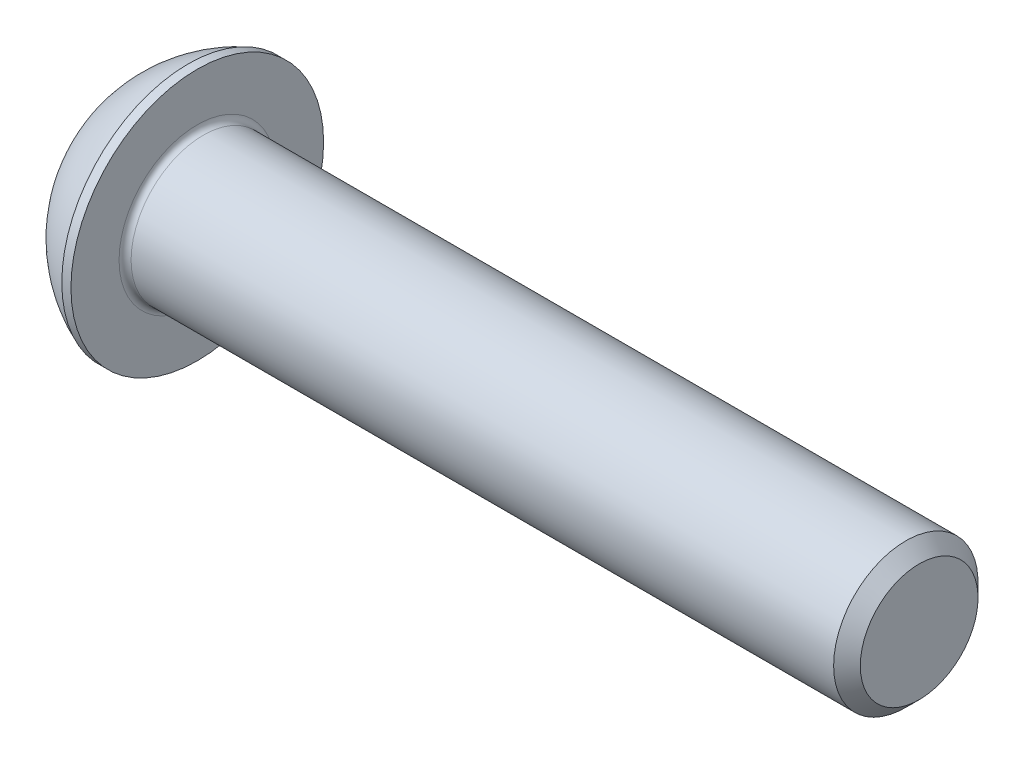
ISO-10303-21;
HEADER;
FILE_DESCRIPTION(('STEP AP214'),'2;1');
FILE_NAME('part.step','',(''),(''),'','','');
FILE_SCHEMA(('AUTOMOTIVE_DESIGN { 1 0 10303 214 1 1 1 1 }'));
ENDSEC;
DATA;
#1=APPLICATION_CONTEXT('core data for automotive mechanical design processes');
#2=APPLICATION_PROTOCOL_DEFINITION('international standard','automotive_design',2000,#1);
#3=PRODUCT_CONTEXT('',#1,'mechanical');
#4=PRODUCT('Part','Part','',(#3));
#5=PRODUCT_RELATED_PRODUCT_CATEGORY('part','',(#4));
#6=PRODUCT_DEFINITION_FORMATION('','',#4);
#7=PRODUCT_DEFINITION_CONTEXT('part definition',#1,'design');
#8=PRODUCT_DEFINITION('design','',#6,#7);
#9=PRODUCT_DEFINITION_SHAPE('','',#8);
#10=(LENGTH_UNIT() NAMED_UNIT(*) SI_UNIT(.MILLI.,.METRE.));
#11=(NAMED_UNIT(*) PLANE_ANGLE_UNIT() SI_UNIT($,.RADIAN.));
#12=(NAMED_UNIT(*) SI_UNIT($,.STERADIAN.) SOLID_ANGLE_UNIT());
#13=UNCERTAINTY_MEASURE_WITH_UNIT(LENGTH_MEASURE(1.E-05),#10,'distance_accuracy_value','');
#14=(GEOMETRIC_REPRESENTATION_CONTEXT(3) GLOBAL_UNCERTAINTY_ASSIGNED_CONTEXT((#13)) GLOBAL_UNIT_ASSIGNED_CONTEXT((#10,
#11,#12)) REPRESENTATION_CONTEXT('',''));
#15=CARTESIAN_POINT('',(0.,0.,0.));
#16=DIRECTION('',(0.,0.,1.));
#17=DIRECTION('',(1.,0.,0.));
#18=AXIS2_PLACEMENT_3D('',#15,#16,#17);
#19=CARTESIAN_POINT('',(0.,0.,0.));
#20=DIRECTION('',(-1.,0.,0.));
#21=DIRECTION('',(0.,0.,1.));
#22=AXIS2_PLACEMENT_3D('',#19,#20,#21);
#23=PLANE('',#22);
#24=CARTESIAN_POINT('',(0.,0.,0.));
#25=DIRECTION('',(-1.,0.,0.));
#26=DIRECTION('',(0.,0.,1.));
#27=AXIS2_PLACEMENT_3D('',#24,#25,#26);
#28=CIRCLE('',#27,2.625);
#29=CARTESIAN_POINT('',(0.,0.,2.625));
#30=VERTEX_POINT('',#29);
#31=EDGE_CURVE('E157',#30,#30,#28,.T.);
#32=ORIENTED_EDGE('',*,*,#31,.T.);
#33=EDGE_LOOP('',(#32));
#34=FACE_BOUND('',#33,.T.);
#35=DIRECTION('',(0.,-1.,0.));
#36=VECTOR('',#35,1.);
#37=CARTESIAN_POINT('',(0.,-1.15470053837925,2.));
#38=LINE('',#37,#36);
#39=CARTESIAN_POINT('',(0.,1.15470053837925,2.));
#40=VERTEX_POINT('',#39);
#41=CARTESIAN_POINT('',(0.,-1.15470053837925,2.));
#42=VERTEX_POINT('',#41);
#43=EDGE_CURVE('E52',#40,#42,#38,.T.);
#44=ORIENTED_EDGE('',*,*,#43,.T.);
#45=DIRECTION('',(0.,-0.5,-0.866025403784438));
#46=VECTOR('',#45,1.);
#47=CARTESIAN_POINT('',(0.,-2.3094010767585,0.));
#48=LINE('',#47,#46);
#49=CARTESIAN_POINT('',(0.,-2.3094010767585,0.));
#50=VERTEX_POINT('',#49);
#51=EDGE_CURVE('E277',#42,#50,#48,.T.);
#52=ORIENTED_EDGE('',*,*,#51,.T.);
#53=DIRECTION('',(0.,0.5,-0.866025403784439));
#54=VECTOR('',#53,1.);
#55=CARTESIAN_POINT('',(0.,-1.15470053837925,-2.));
#56=LINE('',#55,#54);
#57=CARTESIAN_POINT('',(0.,-1.15470053837925,-2.));
#58=VERTEX_POINT('',#57);
#59=EDGE_CURVE('E132',#50,#58,#56,.T.);
#60=ORIENTED_EDGE('',*,*,#59,.T.);
#61=DIRECTION('',(0.,1.,0.));
#62=VECTOR('',#61,1.);
#63=CARTESIAN_POINT('',(0.,1.15470053837925,-2.));
#64=LINE('',#63,#62);
#65=CARTESIAN_POINT('',(0.,1.15470053837925,-2.));
#66=VERTEX_POINT('',#65);
#67=EDGE_CURVE('E280',#58,#66,#64,.T.);
#68=ORIENTED_EDGE('',*,*,#67,.T.);
#69=DIRECTION('',(0.,0.5,0.866025403784439));
#70=VECTOR('',#69,1.);
#71=CARTESIAN_POINT('',(0.,2.3094010767585,0.));
#72=LINE('',#71,#70);
#73=CARTESIAN_POINT('',(0.,2.3094010767585,0.));
#74=VERTEX_POINT('',#73);
#75=EDGE_CURVE('E282',#66,#74,#72,.T.);
#76=ORIENTED_EDGE('',*,*,#75,.T.);
#77=DIRECTION('',(0.,-0.5,0.866025403784439));
#78=VECTOR('',#77,1.);
#79=CARTESIAN_POINT('',(0.,1.15470053837925,2.));
#80=LINE('',#79,#78);
#81=EDGE_CURVE('E284',#74,#40,#80,.T.);
#82=ORIENTED_EDGE('',*,*,#81,.T.);
#83=EDGE_LOOP('',(#44,#52,#60,#68,#76,#82));
#84=FACE_BOUND('',#83,.T.);
#85=ADVANCED_FACE('F37',(#34,#84),#23,.T.);
#86=CARTESIAN_POINT('',(4.99970462328768,0.,0.));
#87=DIRECTION('',(-1.,0.,0.));
#88=DIRECTION('',(0.,1.,0.));
#89=AXIS2_PLACEMENT_3D('',#86,#87,#88);
#90=SPHERICAL_SURFACE('',#89,5.64691697478581);
#91=CARTESIAN_POINT('',(2.92,0.,0.));
#92=DIRECTION('',(-1.,0.,0.));
#93=DIRECTION('',(0.,0.,1.));
#94=AXIS2_PLACEMENT_3D('',#91,#92,#93);
#95=CIRCLE('',#94,5.25);
#96=CARTESIAN_POINT('',(2.92,0.,5.25));
#97=VERTEX_POINT('',#96);
#98=EDGE_CURVE('E154',#97,#97,#95,.T.);
#99=ORIENTED_EDGE('',*,*,#98,.T.);
#100=EDGE_LOOP('',(#99));
#101=FACE_BOUND('',#100,.T.);
#102=ORIENTED_EDGE('',*,*,#31,.F.);
#103=EDGE_LOOP('',(#102));
#104=FACE_BOUND('',#103,.T.);
#105=ADVANCED_FACE('F178',(#101,#104),#90,.T.);
#106=CARTESIAN_POINT('',(0.,0.,0.));
#107=DIRECTION('',(-1.,0.,0.));
#108=DIRECTION('',(0.,0.,1.));
#109=AXIS2_PLACEMENT_3D('',#106,#107,#108);
#110=CYLINDRICAL_SURFACE('',#109,5.25);
#111=ORIENTED_EDGE('',*,*,#98,.F.);
#112=EDGE_LOOP('',(#111));
#113=FACE_BOUND('',#112,.T.);
#114=CARTESIAN_POINT('',(3.3,0.,0.));
#115=DIRECTION('',(-1.,0.,0.));
#116=DIRECTION('',(0.,0.,1.));
#117=AXIS2_PLACEMENT_3D('',#114,#115,#116);
#118=CIRCLE('',#117,5.25);
#119=CARTESIAN_POINT('',(3.3,0.,5.25));
#120=VERTEX_POINT('',#119);
#121=EDGE_CURVE('E151',#120,#120,#118,.T.);
#122=ORIENTED_EDGE('',*,*,#121,.T.);
#123=EDGE_LOOP('',(#122));
#124=FACE_BOUND('',#123,.T.);
#125=ADVANCED_FACE('F183',(#113,#124),#110,.T.);
#126=CARTESIAN_POINT('',(3.3,3.,0.));
#127=DIRECTION('',(-1.,0.,0.));
#128=DIRECTION('',(0.,0.,1.));
#129=AXIS2_PLACEMENT_3D('',#126,#127,#128);
#130=PLANE('',#129);
#131=CARTESIAN_POINT('',(3.3,0.,0.));
#132=DIRECTION('',(-1.,0.,0.));
#133=DIRECTION('',(0.,0.,1.));
#134=AXIS2_PLACEMENT_3D('',#131,#132,#133);
#135=CIRCLE('',#134,3.25);
#136=CARTESIAN_POINT('',(3.3,0.,3.25));
#137=VERTEX_POINT('',#136);
#138=EDGE_CURVE('E45',#137,#137,#135,.T.);
#139=ORIENTED_EDGE('',*,*,#138,.T.);
#140=EDGE_LOOP('',(#139));
#141=FACE_BOUND('',#140,.T.);
#142=ORIENTED_EDGE('',*,*,#121,.F.);
#143=EDGE_LOOP('',(#142));
#144=FACE_BOUND('',#143,.T.);
#145=ADVANCED_FACE('F162',(#141,#144),#130,.F.);
#146=CARTESIAN_POINT('',(0.,0.,0.));
#147=DIRECTION('',(-1.,0.,0.));
#148=DIRECTION('',(0.,0.,1.));
#149=AXIS2_PLACEMENT_3D('',#146,#147,#148);
#150=CYLINDRICAL_SURFACE('',#149,3.);
#151=CARTESIAN_POINT('',(3.55,0.,0.));
#152=DIRECTION('',(-1.,0.,0.));
#153=DIRECTION('',(0.,0.,1.));
#154=AXIS2_PLACEMENT_3D('',#151,#152,#153);
#155=CIRCLE('',#154,3.);
#156=CARTESIAN_POINT('',(3.55,0.,3.));
#157=VERTEX_POINT('',#156);
#158=EDGE_CURVE('E11',#157,#157,#155,.F.);
#159=ORIENTED_EDGE('',*,*,#158,.T.);
#160=EDGE_LOOP('',(#159));
#161=FACE_BOUND('',#160,.T.);
#162=CARTESIAN_POINT('',(32.7455,0.,0.));
#163=DIRECTION('',(-1.,0.,0.));
#164=DIRECTION('',(0.,0.,1.));
#165=AXIS2_PLACEMENT_3D('',#162,#163,#164);
#166=CIRCLE('',#165,3.);
#167=CARTESIAN_POINT('',(32.7455,0.,3.));
#168=VERTEX_POINT('',#167);
#169=EDGE_CURVE('E148',#168,#168,#166,.T.);
#170=ORIENTED_EDGE('',*,*,#169,.T.);
#171=EDGE_LOOP('',(#170));
#172=FACE_BOUND('',#171,.T.);
#173=ADVANCED_FACE('F192',(#161,#172),#150,.T.);
#174=CARTESIAN_POINT('',(33.3,0.,0.));
#175=DIRECTION('',(-1.,0.,0.));
#176=DIRECTION('',(0.,0.,1.));
#177=AXIS2_PLACEMENT_3D('',#174,#175,#176);
#178=CONICAL_SURFACE('',#177,2.4455,0.78539816339745);
#179=ORIENTED_EDGE('',*,*,#169,.F.);
#180=EDGE_LOOP('',(#179));
#181=FACE_BOUND('',#180,.T.);
#182=CARTESIAN_POINT('',(33.3,0.,0.));
#183=DIRECTION('',(-1.,0.,0.));
#184=DIRECTION('',(0.,0.,1.));
#185=AXIS2_PLACEMENT_3D('',#182,#183,#184);
#186=CIRCLE('',#185,2.4455);
#187=CARTESIAN_POINT('',(33.3,0.,2.4455));
#188=VERTEX_POINT('',#187);
#189=EDGE_CURVE('E144',#188,#188,#186,.T.);
#190=ORIENTED_EDGE('',*,*,#189,.T.);
#191=EDGE_LOOP('',(#190));
#192=FACE_BOUND('',#191,.T.);
#193=ADVANCED_FACE('F173',(#181,#192),#178,.T.);
#194=CARTESIAN_POINT('',(33.3,0.,0.));
#195=DIRECTION('',(-1.,0.,0.));
#196=DIRECTION('',(0.,0.,1.));
#197=AXIS2_PLACEMENT_3D('',#194,#195,#196);
#198=PLANE('',#197);
#199=ORIENTED_EDGE('',*,*,#189,.F.);
#200=EDGE_LOOP('',(#199));
#201=FACE_BOUND('',#200,.T.);
#202=ADVANCED_FACE('F166',(#201),#198,.F.);
#203=CARTESIAN_POINT('',(3.55,0.,0.));
#204=DIRECTION('',(-1.,0.,0.));
#205=DIRECTION('',(0.,0.,1.));
#206=AXIS2_PLACEMENT_3D('',#203,#204,#205);
#207=TOROIDAL_SURFACE('',#206,3.25,0.25);
#208=ORIENTED_EDGE('',*,*,#158,.F.);
#209=EDGE_LOOP('',(#208));
#210=FACE_BOUND('',#209,.T.);
#211=ORIENTED_EDGE('',*,*,#138,.F.);
#212=EDGE_LOOP('',(#211));
#213=FACE_BOUND('',#212,.T.);
#214=ADVANCED_FACE('F39',(#210,#213),#207,.F.);
#215=CARTESIAN_POINT('',(2.08,-2.3094010767585,0.));
#216=DIRECTION('',(0.,0.866025403784438,-0.5));
#217=DIRECTION('',(0.,0.5,0.866025403784439));
#218=AXIS2_PLACEMENT_3D('',#215,#216,#217);
#219=PLANE('',#218);
#220=DIRECTION('',(0.,-0.5,-0.866025403784438));
#221=VECTOR('',#220,1.);
#222=CARTESIAN_POINT('',(2.08,-2.3094010767585,0.));
#223=LINE('',#222,#221);
#224=CARTESIAN_POINT('',(2.08,-1.15470053837925,2.));
#225=VERTEX_POINT('',#224);
#226=CARTESIAN_POINT('',(2.08,-1.73205080756888,1.));
#227=VERTEX_POINT('',#226);
#228=EDGE_CURVE('E118',#225,#227,#223,.T.);
#229=ORIENTED_EDGE('',*,*,#228,.T.);
#230=CARTESIAN_POINT('',(2.08,-2.3094010767585,0.));
#231=VERTEX_POINT('',#230);
#232=EDGE_CURVE('E113',#227,#231,#223,.T.);
#233=ORIENTED_EDGE('',*,*,#232,.T.);
#234=DIRECTION('',(-1.,0.,0.));
#235=VECTOR('',#234,1.);
#236=CARTESIAN_POINT('',(2.08,-2.3094010767585,0.));
#237=LINE('',#236,#235);
#238=EDGE_CURVE('E115',#231,#50,#237,.T.);
#239=ORIENTED_EDGE('',*,*,#238,.T.);
#240=ORIENTED_EDGE('',*,*,#51,.F.);
#241=DIRECTION('',(-1.,0.,0.));
#242=VECTOR('',#241,1.);
#243=CARTESIAN_POINT('',(2.08,-1.15470053837925,2.));
#244=LINE('',#243,#242);
#245=EDGE_CURVE('E273',#225,#42,#244,.T.);
#246=ORIENTED_EDGE('',*,*,#245,.F.);
#247=EDGE_LOOP('',(#229,#233,#239,#240,#246));
#248=FACE_BOUND('',#247,.T.);
#249=ADVANCED_FACE('F114',(#248),#219,.T.);
#250=CARTESIAN_POINT('',(2.08,-1.15470053837925,-2.));
#251=DIRECTION('',(0.,0.866025403784439,0.5));
#252=DIRECTION('',(0.,-0.5,0.866025403784439));
#253=AXIS2_PLACEMENT_3D('',#250,#251,#252);
#254=PLANE('',#253);
#255=DIRECTION('',(0.,0.5,-0.866025403784439));
#256=VECTOR('',#255,1.);
#257=CARTESIAN_POINT('',(2.08,-1.15470053837925,-2.));
#258=LINE('',#257,#256);
#259=CARTESIAN_POINT('',(2.08,-1.73205080756888,-1.));
#260=VERTEX_POINT('',#259);
#261=EDGE_CURVE('E60',#231,#260,#258,.T.);
#262=ORIENTED_EDGE('',*,*,#261,.T.);
#263=CARTESIAN_POINT('',(2.08,-1.15470053837925,-2.));
#264=VERTEX_POINT('',#263);
#265=EDGE_CURVE('E127',#260,#264,#258,.T.);
#266=ORIENTED_EDGE('',*,*,#265,.T.);
#267=DIRECTION('',(-1.,0.,0.));
#268=VECTOR('',#267,1.);
#269=CARTESIAN_POINT('',(2.08,-1.15470053837925,-2.));
#270=LINE('',#269,#268);
#271=EDGE_CURVE('E134',#264,#58,#270,.T.);
#272=ORIENTED_EDGE('',*,*,#271,.T.);
#273=ORIENTED_EDGE('',*,*,#59,.F.);
#274=ORIENTED_EDGE('',*,*,#238,.F.);
#275=EDGE_LOOP('',(#262,#266,#272,#273,#274));
#276=FACE_BOUND('',#275,.T.);
#277=ADVANCED_FACE('F130',(#276),#254,.T.);
#278=CARTESIAN_POINT('',(2.08,1.15470053837925,-2.));
#279=DIRECTION('',(0.,0.,1.));
#280=DIRECTION('',(1.,0.,0.));
#281=AXIS2_PLACEMENT_3D('',#278,#279,#280);
#282=PLANE('',#281);
#283=DIRECTION('',(0.,1.,0.));
#284=VECTOR('',#283,1.);
#285=CARTESIAN_POINT('',(2.08,1.15470053837925,-2.));
#286=LINE('',#285,#284);
#287=CARTESIAN_POINT('',(2.08,0.,-2.));
#288=VERTEX_POINT('',#287);
#289=EDGE_CURVE('E254',#264,#288,#286,.T.);
#290=ORIENTED_EDGE('',*,*,#289,.T.);
#291=CARTESIAN_POINT('',(2.08,1.15470053837925,-2.));
#292=VERTEX_POINT('',#291);
#293=EDGE_CURVE('E126',#288,#292,#286,.T.);
#294=ORIENTED_EDGE('',*,*,#293,.T.);
#295=DIRECTION('',(-1.,0.,0.));
#296=VECTOR('',#295,1.);
#297=CARTESIAN_POINT('',(2.08,1.15470053837925,-2.));
#298=LINE('',#297,#296);
#299=EDGE_CURVE('E139',#292,#66,#298,.T.);
#300=ORIENTED_EDGE('',*,*,#299,.T.);
#301=ORIENTED_EDGE('',*,*,#67,.F.);
#302=ORIENTED_EDGE('',*,*,#271,.F.);
#303=EDGE_LOOP('',(#290,#294,#300,#301,#302));
#304=FACE_BOUND('',#303,.T.);
#305=ADVANCED_FACE('F206',(#304),#282,.T.);
#306=CARTESIAN_POINT('',(2.08,2.3094010767585,0.));
#307=DIRECTION('',(0.,-0.866025403784439,0.5));
#308=DIRECTION('',(0.,-0.5,-0.866025403784439));
#309=AXIS2_PLACEMENT_3D('',#306,#307,#308);
#310=PLANE('',#309);
#311=DIRECTION('',(0.,0.5,0.866025403784439));
#312=VECTOR('',#311,1.);
#313=CARTESIAN_POINT('',(2.08,2.3094010767585,0.));
#314=LINE('',#313,#312);
#315=CARTESIAN_POINT('',(2.08,1.73205080756888,-1.));
#316=VERTEX_POINT('',#315);
#317=EDGE_CURVE('E243',#292,#316,#314,.T.);
#318=ORIENTED_EDGE('',*,*,#317,.T.);
#319=CARTESIAN_POINT('',(2.08,2.3094010767585,0.));
#320=VERTEX_POINT('',#319);
#321=EDGE_CURVE('E248',#316,#320,#314,.T.);
#322=ORIENTED_EDGE('',*,*,#321,.T.);
#323=DIRECTION('',(-1.,0.,0.));
#324=VECTOR('',#323,1.);
#325=CARTESIAN_POINT('',(2.08,2.3094010767585,0.));
#326=LINE('',#325,#324);
#327=EDGE_CURVE('E288',#320,#74,#326,.T.);
#328=ORIENTED_EDGE('',*,*,#327,.T.);
#329=ORIENTED_EDGE('',*,*,#75,.F.);
#330=ORIENTED_EDGE('',*,*,#299,.F.);
#331=EDGE_LOOP('',(#318,#322,#328,#329,#330));
#332=FACE_BOUND('',#331,.T.);
#333=ADVANCED_FACE('F209',(#332),#310,.T.);
#334=CARTESIAN_POINT('',(2.08,1.15470053837925,2.));
#335=DIRECTION('',(0.,-0.866025403784439,-0.5));
#336=DIRECTION('',(0.,0.5,-0.866025403784439));
#337=AXIS2_PLACEMENT_3D('',#334,#335,#336);
#338=PLANE('',#337);
#339=DIRECTION('',(0.,-0.5,0.866025403784439));
#340=VECTOR('',#339,1.);
#341=CARTESIAN_POINT('',(2.08,1.15470053837925,2.));
#342=LINE('',#341,#340);
#343=CARTESIAN_POINT('',(2.08,1.73205080756888,1.));
#344=VERTEX_POINT('',#343);
#345=EDGE_CURVE('E251',#320,#344,#342,.T.);
#346=ORIENTED_EDGE('',*,*,#345,.T.);
#347=CARTESIAN_POINT('',(2.08,1.15470053837925,2.));
#348=VERTEX_POINT('',#347);
#349=EDGE_CURVE('E259',#344,#348,#342,.T.);
#350=ORIENTED_EDGE('',*,*,#349,.T.);
#351=DIRECTION('',(-1.,0.,0.));
#352=VECTOR('',#351,1.);
#353=CARTESIAN_POINT('',(2.08,1.15470053837925,2.));
#354=LINE('',#353,#352);
#355=EDGE_CURVE('E272',#348,#40,#354,.T.);
#356=ORIENTED_EDGE('',*,*,#355,.T.);
#357=ORIENTED_EDGE('',*,*,#81,.F.);
#358=ORIENTED_EDGE('',*,*,#327,.F.);
#359=EDGE_LOOP('',(#346,#350,#356,#357,#358));
#360=FACE_BOUND('',#359,.T.);
#361=ADVANCED_FACE('F213',(#360),#338,.T.);
#362=CARTESIAN_POINT('',(2.08,-1.15470053837925,2.));
#363=DIRECTION('',(0.,0.,-1.));
#364=DIRECTION('',(-1.,0.,0.));
#365=AXIS2_PLACEMENT_3D('',#362,#363,#364);
#366=PLANE('',#365);
#367=DIRECTION('',(0.,-1.,0.));
#368=VECTOR('',#367,1.);
#369=CARTESIAN_POINT('',(2.08,-1.15470053837925,2.));
#370=LINE('',#369,#368);
#371=CARTESIAN_POINT('',(2.08,0.,2.));
#372=VERTEX_POINT('',#371);
#373=EDGE_CURVE('E265',#348,#372,#370,.T.);
#374=ORIENTED_EDGE('',*,*,#373,.T.);
#375=EDGE_CURVE('E267',#372,#225,#370,.T.);
#376=ORIENTED_EDGE('',*,*,#375,.T.);
#377=ORIENTED_EDGE('',*,*,#245,.T.);
#378=ORIENTED_EDGE('',*,*,#43,.F.);
#379=ORIENTED_EDGE('',*,*,#355,.F.);
#380=EDGE_LOOP('',(#374,#376,#377,#378,#379));
#381=FACE_BOUND('',#380,.T.);
#382=ADVANCED_FACE('F217',(#381),#366,.T.);
#383=CARTESIAN_POINT('',(2.08,-2.3094010767585,0.));
#384=DIRECTION('',(1.,0.,0.));
#385=DIRECTION('',(0.,0.,-1.));
#386=AXIS2_PLACEMENT_3D('',#383,#384,#385);
#387=PLANE('',#386);
#388=CARTESIAN_POINT('',(2.08,0.,0.));
#389=DIRECTION('',(-1.,0.,0.));
#390=DIRECTION('',(0.,0.,1.));
#391=AXIS2_PLACEMENT_3D('',#388,#389,#390);
#392=CIRCLE('',#391,2.);
#393=EDGE_CURVE('E240',#316,#288,#392,.T.);
#394=ORIENTED_EDGE('',*,*,#393,.F.);
#395=ORIENTED_EDGE('',*,*,#317,.F.);
#396=ORIENTED_EDGE('',*,*,#293,.F.);
#397=EDGE_LOOP('',(#394,#395,#396));
#398=FACE_BOUND('',#397,.T.);
#399=ADVANCED_FACE('F221',(#398),#387,.F.);
#400=EDGE_CURVE('E145',#344,#316,#392,.T.);
#401=ORIENTED_EDGE('',*,*,#400,.F.);
#402=ORIENTED_EDGE('',*,*,#345,.F.);
#403=ORIENTED_EDGE('',*,*,#321,.F.);
#404=EDGE_LOOP('',(#401,#402,#403));
#405=FACE_BOUND('',#404,.T.);
#406=ADVANCED_FACE('F230',(#405),#387,.F.);
#407=EDGE_CURVE('E138',#372,#344,#392,.T.);
#408=ORIENTED_EDGE('',*,*,#407,.F.);
#409=ORIENTED_EDGE('',*,*,#373,.F.);
#410=ORIENTED_EDGE('',*,*,#349,.F.);
#411=EDGE_LOOP('',(#408,#409,#410));
#412=FACE_BOUND('',#411,.T.);
#413=ADVANCED_FACE('F235',(#412),#387,.F.);
#414=EDGE_CURVE('E133',#227,#372,#392,.T.);
#415=ORIENTED_EDGE('',*,*,#414,.F.);
#416=ORIENTED_EDGE('',*,*,#228,.F.);
#417=ORIENTED_EDGE('',*,*,#375,.F.);
#418=EDGE_LOOP('',(#415,#416,#417));
#419=FACE_BOUND('',#418,.T.);
#420=ADVANCED_FACE('F228',(#419),#387,.F.);
#421=EDGE_CURVE('E124',#260,#227,#392,.T.);
#422=ORIENTED_EDGE('',*,*,#421,.F.);
#423=ORIENTED_EDGE('',*,*,#261,.F.);
#424=ORIENTED_EDGE('',*,*,#232,.F.);
#425=EDGE_LOOP('',(#422,#423,#424));
#426=FACE_BOUND('',#425,.T.);
#427=ADVANCED_FACE('F123',(#426),#387,.F.);
#428=EDGE_CURVE('E246',#288,#260,#392,.T.);
#429=ORIENTED_EDGE('',*,*,#428,.F.);
#430=ORIENTED_EDGE('',*,*,#289,.F.);
#431=ORIENTED_EDGE('',*,*,#265,.F.);
#432=EDGE_LOOP('',(#429,#430,#431));
#433=FACE_BOUND('',#432,.T.);
#434=ADVANCED_FACE('F201',(#433),#387,.F.);
#435=CARTESIAN_POINT('',(3.23470053837926,0.,0.));
#436=DIRECTION('',(-1.,0.,0.));
#437=DIRECTION('',(0.,0.,1.));
#438=AXIS2_PLACEMENT_3D('',#435,#436,#437);
#439=CONICAL_SURFACE('',#438,0.,1.04719755119659);
#440=ORIENTED_EDGE('',*,*,#407,.T.);
#441=ORIENTED_EDGE('',*,*,#400,.T.);
#442=ORIENTED_EDGE('',*,*,#393,.T.);
#443=ORIENTED_EDGE('',*,*,#428,.T.);
#444=ORIENTED_EDGE('',*,*,#421,.T.);
#445=ORIENTED_EDGE('',*,*,#414,.T.);
#446=EDGE_LOOP('',(#440,#441,#442,#443,#444,#445));
#447=FACE_BOUND('',#446,.T.);
#448=CARTESIAN_POINT('',(3.23470053837926,0.,0.));
#449=VERTEX_POINT('',#448);
#450=VERTEX_LOOP('',#449);
#451=FACE_BOUND('',#450,.T.);
#452=ADVANCED_FACE('F199',(#447,#451),#439,.F.);
#453=CLOSED_SHELL('',(#85,#105,#125,#145,#173,#193,#202,#214,#249,#277,#305,#333,#361,#382,#399,
#406,#413,#420,#427,#434,#452));
#454=MANIFOLD_SOLID_BREP('B2',#453);
#455=ADVANCED_BREP_SHAPE_REPRESENTATION('',(#18,#454),#14);
#456=SHAPE_DEFINITION_REPRESENTATION(#9,#455);
ENDSEC;
END-ISO-10303-21;
